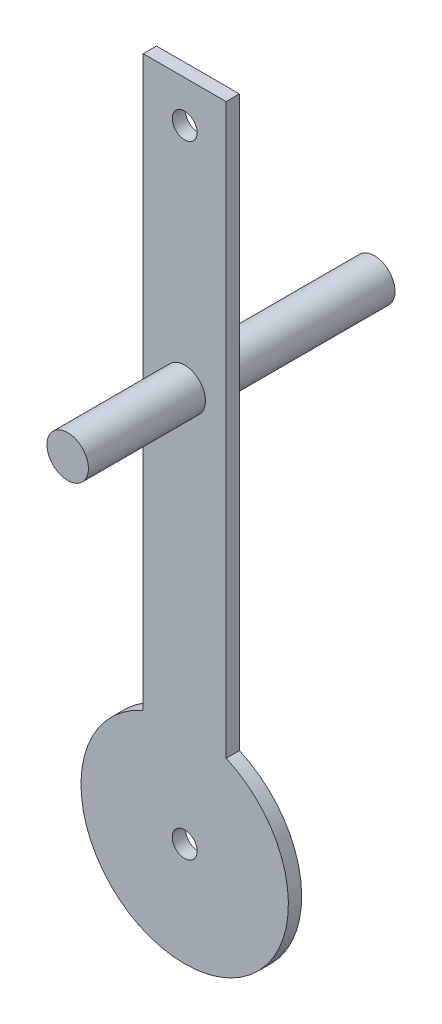
ISO-10303-21;
HEADER;
FILE_DESCRIPTION(('STEP AP214'),'2;1');
FILE_NAME('part.step','',(''),(''),'','','');
FILE_SCHEMA(('AUTOMOTIVE_DESIGN { 1 0 10303 214 1 1 1 1 }'));
ENDSEC;
DATA;
#1=APPLICATION_CONTEXT('core data for automotive mechanical design processes');
#2=APPLICATION_PROTOCOL_DEFINITION('international standard','automotive_design',2000,#1);
#3=PRODUCT_CONTEXT('',#1,'mechanical');
#4=PRODUCT('Part','Part','',(#3));
#5=PRODUCT_RELATED_PRODUCT_CATEGORY('part','',(#4));
#6=PRODUCT_DEFINITION_FORMATION('','',#4);
#7=PRODUCT_DEFINITION_CONTEXT('part definition',#1,'design');
#8=PRODUCT_DEFINITION('design','',#6,#7);
#9=PRODUCT_DEFINITION_SHAPE('','',#8);
#10=(LENGTH_UNIT() NAMED_UNIT(*) SI_UNIT(.MILLI.,.METRE.));
#11=(NAMED_UNIT(*) PLANE_ANGLE_UNIT() SI_UNIT($,.RADIAN.));
#12=(NAMED_UNIT(*) SI_UNIT($,.STERADIAN.) SOLID_ANGLE_UNIT());
#13=UNCERTAINTY_MEASURE_WITH_UNIT(LENGTH_MEASURE(1.E-05),#10,'distance_accuracy_value','');
#14=(GEOMETRIC_REPRESENTATION_CONTEXT(3) GLOBAL_UNCERTAINTY_ASSIGNED_CONTEXT((#13)) GLOBAL_UNIT_ASSIGNED_CONTEXT((#10,
#11,#12)) REPRESENTATION_CONTEXT('',''));
#15=CARTESIAN_POINT('',(0.,0.,0.));
#16=DIRECTION('',(0.,0.,1.));
#17=DIRECTION('',(1.,0.,0.));
#18=AXIS2_PLACEMENT_3D('',#15,#16,#17);
#19=CARTESIAN_POINT('',(5.,-11.4564392373896,1.6));
#20=DIRECTION('',(0.,0.,1.));
#21=DIRECTION('',(1.,0.,0.));
#22=AXIS2_PLACEMENT_3D('',#19,#20,#21);
#23=PLANE('',#22);
#24=CARTESIAN_POINT('',(5.,36.0435607626104,1.6));
#25=DIRECTION('',(0.,0.,1.));
#26=DIRECTION('',(1.,0.,0.));
#27=AXIS2_PLACEMENT_3D('',#24,#25,#26);
#28=CIRCLE('',#27,2.5);
#29=CARTESIAN_POINT('',(7.5,36.0435607626104,1.6));
#30=VERTEX_POINT('',#29);
#31=EDGE_CURVE('E131',#30,#30,#28,.T.);
#32=ORIENTED_EDGE('',*,*,#31,.F.);
#33=EDGE_LOOP('',(#32));
#34=FACE_BOUND('',#33,.T.);
#35=CARTESIAN_POINT('',(5.,63.5435607626104,1.6));
#36=DIRECTION('',(0.,0.,1.));
#37=DIRECTION('',(1.,0.,0.));
#38=AXIS2_PLACEMENT_3D('',#35,#36,#37);
#39=CIRCLE('',#38,1.5);
#40=CARTESIAN_POINT('',(6.5,63.5435607626104,1.6));
#41=VERTEX_POINT('',#40);
#42=EDGE_CURVE('E125',#41,#41,#39,.T.);
#43=ORIENTED_EDGE('',*,*,#42,.F.);
#44=EDGE_LOOP('',(#43));
#45=FACE_BOUND('',#44,.T.);
#46=CARTESIAN_POINT('',(5.,-11.4564392373896,1.6));
#47=DIRECTION('',(0.,0.,1.));
#48=DIRECTION('',(1.,0.,0.));
#49=AXIS2_PLACEMENT_3D('',#46,#47,#48);
#50=CIRCLE('',#49,12.5);
#51=CARTESIAN_POINT('',(0.,0.,1.6));
#52=VERTEX_POINT('',#51);
#53=CARTESIAN_POINT('',(10.,0.,1.6));
#54=VERTEX_POINT('',#53);
#55=EDGE_CURVE('E86',#52,#54,#50,.T.);
#56=ORIENTED_EDGE('',*,*,#55,.T.);
#57=DIRECTION('',(0.,1.,0.));
#58=VECTOR('',#57,1.);
#59=CARTESIAN_POINT('',(10.,0.,1.6));
#60=LINE('',#59,#58);
#61=CARTESIAN_POINT('',(10.,68.5435607626104,1.6));
#62=VERTEX_POINT('',#61);
#63=EDGE_CURVE('E81',#54,#62,#60,.T.);
#64=ORIENTED_EDGE('',*,*,#63,.T.);
#65=DIRECTION('',(-1.,0.,0.));
#66=VECTOR('',#65,1.);
#67=CARTESIAN_POINT('',(0.,68.5435607626104,1.6));
#68=LINE('',#67,#66);
#69=CARTESIAN_POINT('',(0.,68.5435607626104,1.6));
#70=VERTEX_POINT('',#69);
#71=EDGE_CURVE('E84',#62,#70,#68,.T.);
#72=ORIENTED_EDGE('',*,*,#71,.T.);
#73=DIRECTION('',(0.,-1.,0.));
#74=VECTOR('',#73,1.);
#75=CARTESIAN_POINT('',(0.,0.,1.6));
#76=LINE('',#75,#74);
#77=EDGE_CURVE('E50',#70,#52,#76,.T.);
#78=ORIENTED_EDGE('',*,*,#77,.T.);
#79=EDGE_LOOP('',(#56,#64,#72,#78));
#80=FACE_BOUND('',#79,.T.);
#81=CARTESIAN_POINT('',(5.,-11.4564392373896,1.6));
#82=DIRECTION('',(0.,0.,1.));
#83=DIRECTION('',(1.,0.,0.));
#84=AXIS2_PLACEMENT_3D('',#81,#82,#83);
#85=CIRCLE('',#84,1.5);
#86=CARTESIAN_POINT('',(6.5,-11.4564392373896,1.6));
#87=VERTEX_POINT('',#86);
#88=EDGE_CURVE('E103',#87,#87,#85,.T.);
#89=ORIENTED_EDGE('',*,*,#88,.F.);
#90=EDGE_LOOP('',(#89));
#91=FACE_BOUND('',#90,.T.);
#92=ADVANCED_FACE('F33',(#34,#45,#80,#91),#23,.T.);
#93=CARTESIAN_POINT('',(5.,-11.4564392373896,0.));
#94=DIRECTION('',(0.,0.,1.));
#95=DIRECTION('',(1.,0.,0.));
#96=AXIS2_PLACEMENT_3D('',#93,#94,#95);
#97=PLANE('',#96);
#98=CARTESIAN_POINT('',(5.,36.0435607626104,0.));
#99=DIRECTION('',(0.,0.,1.));
#100=DIRECTION('',(1.,0.,0.));
#101=AXIS2_PLACEMENT_3D('',#98,#99,#100);
#102=CIRCLE('',#101,2.5);
#103=CARTESIAN_POINT('',(7.5,36.0435607626104,0.));
#104=VERTEX_POINT('',#103);
#105=EDGE_CURVE('E11',#104,#104,#102,.F.);
#106=ORIENTED_EDGE('',*,*,#105,.F.);
#107=EDGE_LOOP('',(#106));
#108=FACE_BOUND('',#107,.T.);
#109=CARTESIAN_POINT('',(5.,63.5435607626104,0.));
#110=DIRECTION('',(0.,0.,1.));
#111=DIRECTION('',(1.,0.,0.));
#112=AXIS2_PLACEMENT_3D('',#109,#110,#111);
#113=CIRCLE('',#112,1.5);
#114=CARTESIAN_POINT('',(6.5,63.5435607626104,0.));
#115=VERTEX_POINT('',#114);
#116=EDGE_CURVE('E120',#115,#115,#113,.T.);
#117=ORIENTED_EDGE('',*,*,#116,.T.);
#118=EDGE_LOOP('',(#117));
#119=FACE_BOUND('',#118,.T.);
#120=CARTESIAN_POINT('',(5.,-11.4564392373896,0.));
#121=DIRECTION('',(0.,0.,1.));
#122=DIRECTION('',(1.,0.,0.));
#123=AXIS2_PLACEMENT_3D('',#120,#121,#122);
#124=CIRCLE('',#123,12.5);
#125=CARTESIAN_POINT('',(0.,0.,0.));
#126=VERTEX_POINT('',#125);
#127=CARTESIAN_POINT('',(10.,0.,0.));
#128=VERTEX_POINT('',#127);
#129=EDGE_CURVE('E100',#126,#128,#124,.T.);
#130=ORIENTED_EDGE('',*,*,#129,.F.);
#131=DIRECTION('',(0.,-1.,0.));
#132=VECTOR('',#131,1.);
#133=CARTESIAN_POINT('',(0.,0.,0.));
#134=LINE('',#133,#132);
#135=CARTESIAN_POINT('',(0.,68.5435607626104,0.));
#136=VERTEX_POINT('',#135);
#137=EDGE_CURVE('E73',#136,#126,#134,.T.);
#138=ORIENTED_EDGE('',*,*,#137,.F.);
#139=DIRECTION('',(-1.,0.,0.));
#140=VECTOR('',#139,1.);
#141=CARTESIAN_POINT('',(0.,68.5435607626104,0.));
#142=LINE('',#141,#140);
#143=CARTESIAN_POINT('',(10.,68.5435607626104,0.));
#144=VERTEX_POINT('',#143);
#145=EDGE_CURVE('E67',#144,#136,#142,.T.);
#146=ORIENTED_EDGE('',*,*,#145,.F.);
#147=DIRECTION('',(0.,1.,0.));
#148=VECTOR('',#147,1.);
#149=CARTESIAN_POINT('',(10.,0.,0.));
#150=LINE('',#149,#148);
#151=EDGE_CURVE('E91',#128,#144,#150,.T.);
#152=ORIENTED_EDGE('',*,*,#151,.F.);
#153=EDGE_LOOP('',(#130,#138,#146,#152));
#154=FACE_BOUND('',#153,.T.);
#155=CARTESIAN_POINT('',(5.,-11.4564392373896,0.));
#156=DIRECTION('',(0.,0.,1.));
#157=DIRECTION('',(1.,0.,0.));
#158=AXIS2_PLACEMENT_3D('',#155,#156,#157);
#159=CIRCLE('',#158,1.5);
#160=CARTESIAN_POINT('',(6.5,-11.4564392373896,0.));
#161=VERTEX_POINT('',#160);
#162=EDGE_CURVE('E118',#161,#161,#159,.T.);
#163=ORIENTED_EDGE('',*,*,#162,.T.);
#164=EDGE_LOOP('',(#163));
#165=FACE_BOUND('',#164,.T.);
#166=ADVANCED_FACE('F111',(#108,#119,#154,#165),#97,.F.);
#167=CARTESIAN_POINT('',(5.,-11.4564392373896,1.6));
#168=DIRECTION('',(0.,0.,-1.));
#169=DIRECTION('',(-1.,0.,0.));
#170=AXIS2_PLACEMENT_3D('',#167,#168,#169);
#171=CYLINDRICAL_SURFACE('',#170,12.5);
#172=ORIENTED_EDGE('',*,*,#129,.T.);
#173=DIRECTION('',(0.,0.,-1.));
#174=VECTOR('',#173,1.);
#175=CARTESIAN_POINT('',(10.,0.,1.6));
#176=LINE('',#175,#174);
#177=EDGE_CURVE('E42',#54,#128,#176,.T.);
#178=ORIENTED_EDGE('',*,*,#177,.F.);
#179=ORIENTED_EDGE('',*,*,#55,.F.);
#180=DIRECTION('',(0.,0.,-1.));
#181=VECTOR('',#180,1.);
#182=CARTESIAN_POINT('',(0.,0.,1.6));
#183=LINE('',#182,#181);
#184=EDGE_CURVE('E96',#52,#126,#183,.T.);
#185=ORIENTED_EDGE('',*,*,#184,.T.);
#186=EDGE_LOOP('',(#172,#178,#179,#185));
#187=FACE_BOUND('',#186,.T.);
#188=ADVANCED_FACE('F35',(#187),#171,.T.);
#189=CARTESIAN_POINT('',(10.,0.,1.6));
#190=DIRECTION('',(-1.,0.,0.));
#191=DIRECTION('',(0.,-1.,0.));
#192=AXIS2_PLACEMENT_3D('',#189,#190,#191);
#193=PLANE('',#192);
#194=ORIENTED_EDGE('',*,*,#151,.T.);
#195=DIRECTION('',(0.,0.,-1.));
#196=VECTOR('',#195,1.);
#197=CARTESIAN_POINT('',(10.,68.5435607626104,1.6));
#198=LINE('',#197,#196);
#199=EDGE_CURVE('E89',#62,#144,#198,.T.);
#200=ORIENTED_EDGE('',*,*,#199,.F.);
#201=ORIENTED_EDGE('',*,*,#63,.F.);
#202=ORIENTED_EDGE('',*,*,#177,.T.);
#203=EDGE_LOOP('',(#194,#200,#201,#202));
#204=FACE_BOUND('',#203,.T.);
#205=ADVANCED_FACE('F90',(#204),#193,.F.);
#206=CARTESIAN_POINT('',(0.,68.5435607626104,1.6));
#207=DIRECTION('',(0.,-1.,0.));
#208=DIRECTION('',(0.,0.,-1.));
#209=AXIS2_PLACEMENT_3D('',#206,#207,#208);
#210=PLANE('',#209);
#211=ORIENTED_EDGE('',*,*,#145,.T.);
#212=DIRECTION('',(0.,0.,-1.));
#213=VECTOR('',#212,1.);
#214=CARTESIAN_POINT('',(0.,68.5435607626104,1.6));
#215=LINE('',#214,#213);
#216=EDGE_CURVE('E92',#70,#136,#215,.T.);
#217=ORIENTED_EDGE('',*,*,#216,.F.);
#218=ORIENTED_EDGE('',*,*,#71,.F.);
#219=ORIENTED_EDGE('',*,*,#199,.T.);
#220=EDGE_LOOP('',(#211,#217,#218,#219));
#221=FACE_BOUND('',#220,.T.);
#222=ADVANCED_FACE('F94',(#221),#210,.F.);
#223=CARTESIAN_POINT('',(0.,0.,1.6));
#224=DIRECTION('',(1.,0.,0.));
#225=DIRECTION('',(0.,0.,-1.));
#226=AXIS2_PLACEMENT_3D('',#223,#224,#225);
#227=PLANE('',#226);
#228=ORIENTED_EDGE('',*,*,#137,.T.);
#229=ORIENTED_EDGE('',*,*,#184,.F.);
#230=ORIENTED_EDGE('',*,*,#77,.F.);
#231=ORIENTED_EDGE('',*,*,#216,.T.);
#232=EDGE_LOOP('',(#228,#229,#230,#231));
#233=FACE_BOUND('',#232,.T.);
#234=ADVANCED_FACE('F167',(#233),#227,.F.);
#235=CARTESIAN_POINT('',(5.,-11.4564392373896,1.6));
#236=DIRECTION('',(0.,0.,-1.));
#237=DIRECTION('',(-1.,0.,0.));
#238=AXIS2_PLACEMENT_3D('',#235,#236,#237);
#239=CYLINDRICAL_SURFACE('',#238,1.5);
#240=ORIENTED_EDGE('',*,*,#88,.T.);
#241=EDGE_LOOP('',(#240));
#242=FACE_BOUND('',#241,.T.);
#243=ORIENTED_EDGE('',*,*,#162,.F.);
#244=EDGE_LOOP('',(#243));
#245=FACE_BOUND('',#244,.T.);
#246=ADVANCED_FACE('F155',(#242,#245),#239,.F.);
#247=CARTESIAN_POINT('',(5.,63.5435607626104,0.));
#248=DIRECTION('',(0.,0.,1.));
#249=DIRECTION('',(1.,0.,0.));
#250=AXIS2_PLACEMENT_3D('',#247,#248,#249);
#251=CYLINDRICAL_SURFACE('',#250,1.5);
#252=ORIENTED_EDGE('',*,*,#116,.F.);
#253=EDGE_LOOP('',(#252));
#254=FACE_BOUND('',#253,.T.);
#255=ORIENTED_EDGE('',*,*,#42,.T.);
#256=EDGE_LOOP('',(#255));
#257=FACE_BOUND('',#256,.T.);
#258=ADVANCED_FACE('F151',(#254,#257),#251,.F.);
#259=CARTESIAN_POINT('',(5.,36.0435607626104,15.7));
#260=DIRECTION('',(0.,0.,-1.));
#261=DIRECTION('',(-1.,0.,0.));
#262=AXIS2_PLACEMENT_3D('',#259,#260,#261);
#263=CYLINDRICAL_SURFACE('',#262,2.5);
#264=CARTESIAN_POINT('',(5.,36.0435607626104,15.7));
#265=DIRECTION('',(0.,0.,1.));
#266=DIRECTION('',(1.,0.,0.));
#267=AXIS2_PLACEMENT_3D('',#264,#265,#266);
#268=CIRCLE('',#267,2.5);
#269=CARTESIAN_POINT('',(7.5,36.0435607626104,15.7));
#270=VERTEX_POINT('',#269);
#271=EDGE_CURVE('E129',#270,#270,#268,.T.);
#272=ORIENTED_EDGE('',*,*,#271,.F.);
#273=EDGE_LOOP('',(#272));
#274=FACE_BOUND('',#273,.T.);
#275=ORIENTED_EDGE('',*,*,#31,.T.);
#276=EDGE_LOOP('',(#275));
#277=FACE_BOUND('',#276,.T.);
#278=ADVANCED_FACE('F154',(#274,#277),#263,.T.);
#279=CARTESIAN_POINT('',(5.,36.0435607626104,15.7));
#280=DIRECTION('',(0.,0.,1.));
#281=DIRECTION('',(1.,0.,0.));
#282=AXIS2_PLACEMENT_3D('',#279,#280,#281);
#283=PLANE('',#282);
#284=ORIENTED_EDGE('',*,*,#271,.T.);
#285=EDGE_LOOP('',(#284));
#286=FACE_BOUND('',#285,.T.);
#287=ADVANCED_FACE('F145',(#286),#283,.T.);
#288=CARTESIAN_POINT('',(5.,36.0435607626104,-21.25));
#289=DIRECTION('',(0.,0.,1.));
#290=DIRECTION('',(1.,0.,0.));
#291=AXIS2_PLACEMENT_3D('',#288,#289,#290);
#292=CYLINDRICAL_SURFACE('',#291,2.5);
#293=CARTESIAN_POINT('',(5.,36.0435607626104,-21.25));
#294=DIRECTION('',(0.,0.,-1.));
#295=DIRECTION('',(-1.,0.,0.));
#296=AXIS2_PLACEMENT_3D('',#293,#294,#295);
#297=CIRCLE('',#296,2.5);
#298=CARTESIAN_POINT('',(2.5,36.0435607626104,-21.25));
#299=VERTEX_POINT('',#298);
#300=EDGE_CURVE('E134',#299,#299,#297,.T.);
#301=ORIENTED_EDGE('',*,*,#300,.F.);
#302=EDGE_LOOP('',(#301));
#303=FACE_BOUND('',#302,.T.);
#304=ORIENTED_EDGE('',*,*,#105,.T.);
#305=EDGE_LOOP('',(#304));
#306=FACE_BOUND('',#305,.T.);
#307=ADVANCED_FACE('F142',(#303,#306),#292,.T.);
#308=CARTESIAN_POINT('',(5.,36.0435607626104,-21.25));
#309=DIRECTION('',(0.,0.,-1.));
#310=DIRECTION('',(-1.,0.,0.));
#311=AXIS2_PLACEMENT_3D('',#308,#309,#310);
#312=PLANE('',#311);
#313=ORIENTED_EDGE('',*,*,#300,.T.);
#314=EDGE_LOOP('',(#313));
#315=FACE_BOUND('',#314,.T.);
#316=ADVANCED_FACE('F140',(#315),#312,.T.);
#317=CLOSED_SHELL('',(#92,#166,#188,#205,#222,#234,#246,#258,#278,#287,#307,#316));
#318=MANIFOLD_SOLID_BREP('B2',#317);
#319=ADVANCED_BREP_SHAPE_REPRESENTATION('',(#18,#318),#14);
#320=SHAPE_DEFINITION_REPRESENTATION(#9,#319);
ENDSEC;
END-ISO-10303-21;
